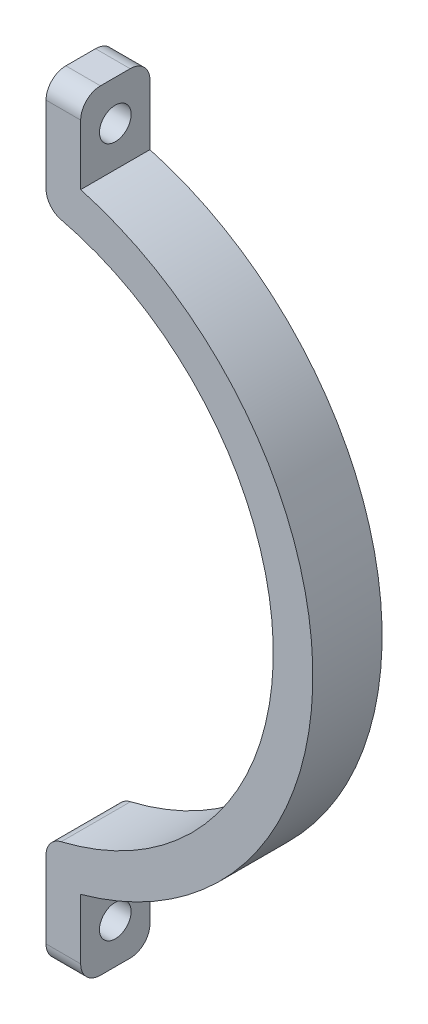
ISO-10303-21;
HEADER;
FILE_DESCRIPTION(('STEP AP214'),'2;1');
FILE_NAME('part.step','',(''),(''),'','','');
FILE_SCHEMA(('AUTOMOTIVE_DESIGN { 1 0 10303 214 1 1 1 1 }'));
ENDSEC;
DATA;
#1=APPLICATION_CONTEXT('core data for automotive mechanical design processes');
#2=APPLICATION_PROTOCOL_DEFINITION('international standard','automotive_design',2000,#1);
#3=PRODUCT_CONTEXT('',#1,'mechanical');
#4=PRODUCT('Part','Part','',(#3));
#5=PRODUCT_RELATED_PRODUCT_CATEGORY('part','',(#4));
#6=PRODUCT_DEFINITION_FORMATION('','',#4);
#7=PRODUCT_DEFINITION_CONTEXT('part definition',#1,'design');
#8=PRODUCT_DEFINITION('design','',#6,#7);
#9=PRODUCT_DEFINITION_SHAPE('','',#8);
#10=(LENGTH_UNIT() NAMED_UNIT(*) SI_UNIT(.MILLI.,.METRE.));
#11=(NAMED_UNIT(*) PLANE_ANGLE_UNIT() SI_UNIT($,.RADIAN.));
#12=(NAMED_UNIT(*) SI_UNIT($,.STERADIAN.) SOLID_ANGLE_UNIT());
#13=UNCERTAINTY_MEASURE_WITH_UNIT(LENGTH_MEASURE(1.E-05),#10,'distance_accuracy_value','');
#14=(GEOMETRIC_REPRESENTATION_CONTEXT(3) GLOBAL_UNCERTAINTY_ASSIGNED_CONTEXT((#13)) GLOBAL_UNIT_ASSIGNED_CONTEXT((#10,
#11,#12)) REPRESENTATION_CONTEXT('',''));
#15=CARTESIAN_POINT('',(0.,0.,0.));
#16=DIRECTION('',(0.,0.,1.));
#17=DIRECTION('',(1.,0.,0.));
#18=AXIS2_PLACEMENT_3D('',#15,#16,#17);
#19=CARTESIAN_POINT('',(103.,-22.5859511028397,-38.));
#20=DIRECTION('',(0.,0.,1.));
#21=DIRECTION('',(1.,0.,0.));
#22=AXIS2_PLACEMENT_3D('',#19,#20,#21);
#23=CYLINDRICAL_SURFACE('',#22,28.);
#24=CARTESIAN_POINT('',(103.,-22.5859511028397,-31.));
#25=DIRECTION('',(0.,0.,-1.));
#26=DIRECTION('',(-1.,0.,0.));
#27=AXIS2_PLACEMENT_3D('',#24,#25,#26);
#28=CIRCLE('',#27,28.);
#29=CARTESIAN_POINT('',(109.564444444444,4.63367544007598,-31.));
#30=VERTEX_POINT('',#29);
#31=CARTESIAN_POINT('',(109.564444444444,-49.8055776457555,-31.));
#32=VERTEX_POINT('',#31);
#33=EDGE_CURVE('E177',#30,#32,#28,.T.);
#34=ORIENTED_EDGE('',*,*,#33,.F.);
#35=DIRECTION('',(0.,0.,1.));
#36=VECTOR('',#35,1.);
#37=CARTESIAN_POINT('',(109.564444444444,4.63367544007599,-38.));
#38=LINE('',#37,#36);
#39=CARTESIAN_POINT('',(109.564444444444,4.63367544007598,-38.));
#40=VERTEX_POINT('',#39);
#41=EDGE_CURVE('E253',#30,#40,#38,.F.);
#42=ORIENTED_EDGE('',*,*,#41,.T.);
#43=CARTESIAN_POINT('',(103.,-22.5859511028397,-38.));
#44=DIRECTION('',(0.,0.,-1.));
#45=DIRECTION('',(-1.,0.,0.));
#46=AXIS2_PLACEMENT_3D('',#43,#44,#45);
#47=CIRCLE('',#46,28.);
#48=CARTESIAN_POINT('',(109.564444444444,-49.8055776457555,-38.));
#49=VERTEX_POINT('',#48);
#50=EDGE_CURVE('E191',#40,#49,#47,.T.);
#51=ORIENTED_EDGE('',*,*,#50,.T.);
#52=DIRECTION('',(0.,0.,1.));
#53=VECTOR('',#52,1.);
#54=CARTESIAN_POINT('',(109.564444444444,-49.8055776457555,-38.));
#55=LINE('',#54,#53);
#56=EDGE_CURVE('E250',#49,#32,#55,.T.);
#57=ORIENTED_EDGE('',*,*,#56,.T.);
#58=EDGE_LOOP('',(#34,#42,#51,#57));
#59=FACE_BOUND('',#58,.T.);
#60=ADVANCED_FACE('F43',(#59),#23,.F.);
#61=CARTESIAN_POINT('',(108.033333333333,1.31702744907367E-13,-38.));
#62=DIRECTION('',(1.,0.,0.));
#63=DIRECTION('',(0.,1.,0.));
#64=AXIS2_PLACEMENT_3D('',#61,#62,#63);
#65=PLANE('',#64);
#66=CARTESIAN_POINT('',(108.033333333333,12.298458831268,-34.5));
#67=DIRECTION('',(1.,0.,0.));
#68=DIRECTION('',(0.,1.,0.));
#69=AXIS2_PLACEMENT_3D('',#66,#67,#68);
#70=CIRCLE('',#69,1.59999999999999);
#71=CARTESIAN_POINT('',(108.033333333333,13.898458831268,-34.5));
#72=VERTEX_POINT('',#71);
#73=EDGE_CURVE('E181',#72,#72,#70,.T.);
#74=ORIENTED_EDGE('',*,*,#73,.T.);
#75=EDGE_LOOP('',(#74));
#76=FACE_BOUND('',#75,.T.);
#77=DIRECTION('',(0.,1.,0.));
#78=VECTOR('',#77,1.);
#79=CARTESIAN_POINT('',(108.033333333333,1.31702744907367E-13,-38.));
#80=LINE('',#79,#78);
#81=CARTESIAN_POINT('',(108.033333333333,6.57793447885567,-38.));
#82=VERTEX_POINT('',#81);
#83=CARTESIAN_POINT('',(108.033333333333,14.341626536467,-38.));
#84=VERTEX_POINT('',#83);
#85=EDGE_CURVE('E154',#82,#84,#80,.T.);
#86=ORIENTED_EDGE('',*,*,#85,.F.);
#87=DIRECTION('',(0.,0.,-1.));
#88=VECTOR('',#87,1.);
#89=CARTESIAN_POINT('',(108.033333333333,6.57793447885567,-31.));
#90=LINE('',#89,#88);
#91=CARTESIAN_POINT('',(108.033333333333,6.57793447885567,-31.));
#92=VERTEX_POINT('',#91);
#93=EDGE_CURVE('E243',#82,#92,#90,.F.);
#94=ORIENTED_EDGE('',*,*,#93,.T.);
#95=DIRECTION('',(0.,1.,0.));
#96=VECTOR('',#95,1.);
#97=CARTESIAN_POINT('',(108.033333333333,1.31702744907367E-13,-31.));
#98=LINE('',#97,#96);
#99=CARTESIAN_POINT('',(108.033333333333,14.341626536467,-31.));
#100=VERTEX_POINT('',#99);
#101=EDGE_CURVE('E180',#92,#100,#98,.T.);
#102=ORIENTED_EDGE('',*,*,#101,.T.);
#103=CARTESIAN_POINT('',(108.033333333333,14.341626536467,-33.));
#104=DIRECTION('',(1.,0.,0.));
#105=DIRECTION('',(0.,1.,0.));
#106=AXIS2_PLACEMENT_3D('',#103,#104,#105);
#107=CIRCLE('',#106,2.);
#108=CARTESIAN_POINT('',(108.033333333333,16.341626536467,-33.));
#109=VERTEX_POINT('',#108);
#110=EDGE_CURVE('E238',#100,#109,#107,.F.);
#111=ORIENTED_EDGE('',*,*,#110,.T.);
#112=DIRECTION('',(0.,0.,1.));
#113=VECTOR('',#112,1.);
#114=CARTESIAN_POINT('',(108.033333333333,16.341626536467,-38.));
#115=LINE('',#114,#113);
#116=CARTESIAN_POINT('',(108.033333333333,16.341626536467,-36.));
#117=VERTEX_POINT('',#116);
#118=EDGE_CURVE('E200',#117,#109,#115,.T.);
#119=ORIENTED_EDGE('',*,*,#118,.F.);
#120=CARTESIAN_POINT('',(108.033333333333,14.341626536467,-36.));
#121=DIRECTION('',(1.,0.,0.));
#122=DIRECTION('',(0.,1.,0.));
#123=AXIS2_PLACEMENT_3D('',#120,#121,#122);
#124=CIRCLE('',#123,2.);
#125=EDGE_CURVE('E240',#117,#84,#124,.F.);
#126=ORIENTED_EDGE('',*,*,#125,.T.);
#127=EDGE_LOOP('',(#86,#94,#102,#111,#119,#126));
#128=FACE_BOUND('',#127,.T.);
#129=ADVANCED_FACE('F261',(#76,#128),#65,.F.);
#130=CARTESIAN_POINT('',(0.,16.341626536467,-38.));
#131=DIRECTION('',(0.,-1.,0.));
#132=DIRECTION('',(0.,0.,-1.));
#133=AXIS2_PLACEMENT_3D('',#130,#131,#132);
#134=PLANE('',#133);
#135=DIRECTION('',(0.,0.,1.));
#136=VECTOR('',#135,1.);
#137=CARTESIAN_POINT('',(111.533333333333,16.341626536467,-38.));
#138=LINE('',#137,#136);
#139=CARTESIAN_POINT('',(111.533333333333,16.341626536467,-36.));
#140=VERTEX_POINT('',#139);
#141=CARTESIAN_POINT('',(111.533333333333,16.341626536467,-33.));
#142=VERTEX_POINT('',#141);
#143=EDGE_CURVE('E163',#140,#142,#138,.T.);
#144=ORIENTED_EDGE('',*,*,#143,.F.);
#145=DIRECTION('',(1.,0.,0.));
#146=VECTOR('',#145,1.);
#147=CARTESIAN_POINT('',(108.033333333333,16.341626536467,-36.));
#148=LINE('',#147,#146);
#149=EDGE_CURVE('E236',#140,#117,#148,.F.);
#150=ORIENTED_EDGE('',*,*,#149,.T.);
#151=ORIENTED_EDGE('',*,*,#118,.T.);
#152=DIRECTION('',(1.,0.,0.));
#153=VECTOR('',#152,1.);
#154=CARTESIAN_POINT('',(0.,16.341626536467,-33.));
#155=LINE('',#154,#153);
#156=EDGE_CURVE('E233',#109,#142,#155,.T.);
#157=ORIENTED_EDGE('',*,*,#156,.T.);
#158=EDGE_LOOP('',(#144,#150,#151,#157));
#159=FACE_BOUND('',#158,.T.);
#160=ADVANCED_FACE('F298',(#159),#134,.F.);
#161=CARTESIAN_POINT('',(111.533333333333,0.,-38.));
#162=DIRECTION('',(-1.,0.,0.));
#163=DIRECTION('',(0.,0.,1.));
#164=AXIS2_PLACEMENT_3D('',#161,#162,#163);
#165=PLANE('',#164);
#166=CARTESIAN_POINT('',(111.533333333333,12.298458831268,-34.5));
#167=DIRECTION('',(1.,0.,0.));
#168=DIRECTION('',(0.,0.,1.));
#169=AXIS2_PLACEMENT_3D('',#166,#167,#168);
#170=CIRCLE('',#169,1.59999999999999);
#171=CARTESIAN_POINT('',(111.533333333333,12.298458831268,-32.9));
#172=VERTEX_POINT('',#171);
#173=EDGE_CURVE('E455',#172,#172,#170,.T.);
#174=ORIENTED_EDGE('',*,*,#173,.F.);
#175=EDGE_LOOP('',(#174));
#176=FACE_BOUND('',#175,.T.);
#177=DIRECTION('',(0.,-1.,0.));
#178=VECTOR('',#177,1.);
#179=CARTESIAN_POINT('',(111.533333333333,0.,-38.));
#180=LINE('',#179,#178);
#181=CARTESIAN_POINT('',(111.533333333333,14.341626536467,-38.));
#182=VERTEX_POINT('',#181);
#183=CARTESIAN_POINT('',(111.533333333333,8.25529112606897,-38.));
#184=VERTEX_POINT('',#183);
#185=EDGE_CURVE('E144',#182,#184,#180,.T.);
#186=ORIENTED_EDGE('',*,*,#185,.F.);
#187=CARTESIAN_POINT('',(111.533333333333,14.341626536467,-36.));
#188=DIRECTION('',(-1.,0.,0.));
#189=DIRECTION('',(0.,0.,1.));
#190=AXIS2_PLACEMENT_3D('',#187,#188,#189);
#191=CIRCLE('',#190,2.);
#192=EDGE_CURVE('E231',#182,#140,#191,.F.);
#193=ORIENTED_EDGE('',*,*,#192,.T.);
#194=ORIENTED_EDGE('',*,*,#143,.T.);
#195=CARTESIAN_POINT('',(111.533333333333,14.341626536467,-33.));
#196=DIRECTION('',(-1.,0.,0.));
#197=DIRECTION('',(0.,0.,1.));
#198=AXIS2_PLACEMENT_3D('',#195,#196,#197);
#199=CIRCLE('',#198,2.);
#200=CARTESIAN_POINT('',(111.533333333333,14.341626536467,-31.));
#201=VERTEX_POINT('',#200);
#202=EDGE_CURVE('E229',#142,#201,#199,.F.);
#203=ORIENTED_EDGE('',*,*,#202,.T.);
#204=DIRECTION('',(0.,-1.,0.));
#205=VECTOR('',#204,1.);
#206=CARTESIAN_POINT('',(111.533333333333,0.,-31.));
#207=LINE('',#206,#205);
#208=CARTESIAN_POINT('',(111.533333333333,8.25529112606897,-31.));
#209=VERTEX_POINT('',#208);
#210=EDGE_CURVE('E160',#201,#209,#207,.T.);
#211=ORIENTED_EDGE('',*,*,#210,.T.);
#212=DIRECTION('',(0.,0.,1.));
#213=VECTOR('',#212,1.);
#214=CARTESIAN_POINT('',(111.533333333333,8.25529112606897,-38.));
#215=LINE('',#214,#213);
#216=EDGE_CURVE('E157',#184,#209,#215,.T.);
#217=ORIENTED_EDGE('',*,*,#216,.F.);
#218=EDGE_LOOP('',(#186,#193,#194,#203,#211,#217));
#219=FACE_BOUND('',#218,.T.);
#220=ADVANCED_FACE('F158',(#176,#219),#165,.F.);
#221=CARTESIAN_POINT('',(103.,-22.5859511028397,-38.));
#222=DIRECTION('',(0.,0.,1.));
#223=DIRECTION('',(1.,0.,0.));
#224=AXIS2_PLACEMENT_3D('',#221,#222,#223);
#225=CYLINDRICAL_SURFACE('',#224,32.);
#226=CARTESIAN_POINT('',(103.,-22.5859511028397,-31.));
#227=DIRECTION('',(0.,0.,-1.));
#228=DIRECTION('',(-1.,0.,0.));
#229=AXIS2_PLACEMENT_3D('',#226,#227,#228);
#230=CIRCLE('',#229,32.);
#231=CARTESIAN_POINT('',(111.533333333333,-53.4271933317485,-31.));
#232=VERTEX_POINT('',#231);
#233=EDGE_CURVE('E184',#209,#232,#230,.T.);
#234=ORIENTED_EDGE('',*,*,#233,.T.);
#235=DIRECTION('',(0.,0.,1.));
#236=VECTOR('',#235,1.);
#237=CARTESIAN_POINT('',(111.533333333333,-53.4271933317485,-38.));
#238=LINE('',#237,#236);
#239=CARTESIAN_POINT('',(111.533333333333,-53.4271933317485,-38.));
#240=VERTEX_POINT('',#239);
#241=EDGE_CURVE('E164',#240,#232,#238,.T.);
#242=ORIENTED_EDGE('',*,*,#241,.F.);
#243=CARTESIAN_POINT('',(103.,-22.5859511028397,-38.));
#244=DIRECTION('',(0.,0.,-1.));
#245=DIRECTION('',(-1.,0.,0.));
#246=AXIS2_PLACEMENT_3D('',#243,#244,#245);
#247=CIRCLE('',#246,32.);
#248=EDGE_CURVE('E149',#184,#240,#247,.T.);
#249=ORIENTED_EDGE('',*,*,#248,.F.);
#250=ORIENTED_EDGE('',*,*,#216,.T.);
#251=EDGE_LOOP('',(#234,#242,#249,#250));
#252=FACE_BOUND('',#251,.T.);
#253=ADVANCED_FACE('F166',(#252),#225,.T.);
#254=CARTESIAN_POINT('',(111.533333333333,0.,-38.));
#255=DIRECTION('',(-1.,0.,0.));
#256=DIRECTION('',(0.,0.,1.));
#257=AXIS2_PLACEMENT_3D('',#254,#255,#256);
#258=PLANE('',#257);
#259=CARTESIAN_POINT('',(111.533333333333,-57.4703610369475,-34.5));
#260=DIRECTION('',(1.,0.,0.));
#261=DIRECTION('',(0.,0.,-1.));
#262=AXIS2_PLACEMENT_3D('',#259,#260,#261);
#263=CIRCLE('',#262,1.6);
#264=CARTESIAN_POINT('',(111.533333333333,-57.4703610369475,-36.1));
#265=VERTEX_POINT('',#264);
#266=EDGE_CURVE('E206',#265,#265,#263,.T.);
#267=ORIENTED_EDGE('',*,*,#266,.F.);
#268=EDGE_LOOP('',(#267));
#269=FACE_BOUND('',#268,.T.);
#270=DIRECTION('',(0.,0.,1.));
#271=VECTOR('',#270,1.);
#272=CARTESIAN_POINT('',(111.533333333333,-61.5135287421465,-38.));
#273=LINE('',#272,#271);
#274=CARTESIAN_POINT('',(111.533333333333,-61.5135287421465,-36.));
#275=VERTEX_POINT('',#274);
#276=CARTESIAN_POINT('',(111.533333333333,-61.5135287421465,-33.));
#277=VERTEX_POINT('',#276);
#278=EDGE_CURVE('E194',#275,#277,#273,.T.);
#279=ORIENTED_EDGE('',*,*,#278,.F.);
#280=CARTESIAN_POINT('',(111.533333333333,-59.5135287421465,-36.));
#281=DIRECTION('',(-1.,0.,0.));
#282=DIRECTION('',(0.,0.,1.));
#283=AXIS2_PLACEMENT_3D('',#280,#281,#282);
#284=CIRCLE('',#283,2.);
#285=CARTESIAN_POINT('',(111.533333333333,-59.5135287421465,-38.));
#286=VERTEX_POINT('',#285);
#287=EDGE_CURVE('E222',#275,#286,#284,.F.);
#288=ORIENTED_EDGE('',*,*,#287,.T.);
#289=DIRECTION('',(0.,-1.,0.));
#290=VECTOR('',#289,1.);
#291=CARTESIAN_POINT('',(111.533333333333,0.,-38.));
#292=LINE('',#291,#290);
#293=EDGE_CURVE('E169',#240,#286,#292,.T.);
#294=ORIENTED_EDGE('',*,*,#293,.F.);
#295=ORIENTED_EDGE('',*,*,#241,.T.);
#296=DIRECTION('',(0.,-1.,0.));
#297=VECTOR('',#296,1.);
#298=CARTESIAN_POINT('',(111.533333333333,0.,-31.));
#299=LINE('',#298,#297);
#300=CARTESIAN_POINT('',(111.533333333333,-59.5135287421465,-31.));
#301=VERTEX_POINT('',#300);
#302=EDGE_CURVE('E186',#232,#301,#299,.T.);
#303=ORIENTED_EDGE('',*,*,#302,.T.);
#304=CARTESIAN_POINT('',(111.533333333333,-59.5135287421465,-33.));
#305=DIRECTION('',(-1.,0.,0.));
#306=DIRECTION('',(0.,0.,1.));
#307=AXIS2_PLACEMENT_3D('',#304,#305,#306);
#308=CIRCLE('',#307,2.);
#309=EDGE_CURVE('E220',#301,#277,#308,.F.);
#310=ORIENTED_EDGE('',*,*,#309,.T.);
#311=EDGE_LOOP('',(#279,#288,#294,#295,#303,#310));
#312=FACE_BOUND('',#311,.T.);
#313=ADVANCED_FACE('F286',(#269,#312),#258,.F.);
#314=CARTESIAN_POINT('',(0.,-61.5135287421465,-38.));
#315=DIRECTION('',(0.,1.,0.));
#316=DIRECTION('',(0.,0.,1.));
#317=AXIS2_PLACEMENT_3D('',#314,#315,#316);
#318=PLANE('',#317);
#319=DIRECTION('',(0.,0.,1.));
#320=VECTOR('',#319,1.);
#321=CARTESIAN_POINT('',(108.033333333333,-61.5135287421465,-38.));
#322=LINE('',#321,#320);
#323=CARTESIAN_POINT('',(108.033333333333,-61.5135287421465,-36.));
#324=VERTEX_POINT('',#323);
#325=CARTESIAN_POINT('',(108.033333333333,-61.5135287421465,-33.));
#326=VERTEX_POINT('',#325);
#327=EDGE_CURVE('E176',#324,#326,#322,.T.);
#328=ORIENTED_EDGE('',*,*,#327,.F.);
#329=DIRECTION('',(-1.,0.,0.));
#330=VECTOR('',#329,1.);
#331=CARTESIAN_POINT('',(111.533333333333,-61.5135287421465,-36.));
#332=LINE('',#331,#330);
#333=EDGE_CURVE('E218',#324,#275,#332,.F.);
#334=ORIENTED_EDGE('',*,*,#333,.T.);
#335=ORIENTED_EDGE('',*,*,#278,.T.);
#336=DIRECTION('',(-1.,0.,0.));
#337=VECTOR('',#336,1.);
#338=CARTESIAN_POINT('',(0.,-61.5135287421465,-33.));
#339=LINE('',#338,#337);
#340=EDGE_CURVE('E215',#277,#326,#339,.T.);
#341=ORIENTED_EDGE('',*,*,#340,.T.);
#342=EDGE_LOOP('',(#328,#334,#335,#341));
#343=FACE_BOUND('',#342,.T.);
#344=ADVANCED_FACE('F281',(#343),#318,.F.);
#345=CARTESIAN_POINT('',(108.033333333334,-2.63405489814734E-13,-38.));
#346=DIRECTION('',(1.,0.,0.));
#347=DIRECTION('',(0.,1.,0.));
#348=AXIS2_PLACEMENT_3D('',#345,#346,#347);
#349=PLANE('',#348);
#350=CARTESIAN_POINT('',(108.033333333333,-57.4703610369475,-34.5));
#351=DIRECTION('',(1.,0.,0.));
#352=DIRECTION('',(0.,1.,0.));
#353=AXIS2_PLACEMENT_3D('',#350,#351,#352);
#354=CIRCLE('',#353,1.6);
#355=CARTESIAN_POINT('',(108.033333333333,-55.8703610369475,-34.5));
#356=VERTEX_POINT('',#355);
#357=EDGE_CURVE('E203',#356,#356,#354,.T.);
#358=ORIENTED_EDGE('',*,*,#357,.T.);
#359=EDGE_LOOP('',(#358));
#360=FACE_BOUND('',#359,.T.);
#361=DIRECTION('',(0.,1.,0.));
#362=VECTOR('',#361,1.);
#363=CARTESIAN_POINT('',(108.033333333334,-2.63405489814734E-13,-31.));
#364=LINE('',#363,#362);
#365=CARTESIAN_POINT('',(108.033333333333,-59.5135287421465,-31.));
#366=VERTEX_POINT('',#365);
#367=CARTESIAN_POINT('',(108.033333333333,-51.7498366845352,-31.));
#368=VERTEX_POINT('',#367);
#369=EDGE_CURVE('E189',#366,#368,#364,.T.);
#370=ORIENTED_EDGE('',*,*,#369,.T.);
#371=DIRECTION('',(0.,0.,-1.));
#372=VECTOR('',#371,1.);
#373=CARTESIAN_POINT('',(108.033333333333,-51.7498366845352,-38.));
#374=LINE('',#373,#372);
#375=CARTESIAN_POINT('',(108.033333333333,-51.7498366845352,-38.));
#376=VERTEX_POINT('',#375);
#377=EDGE_CURVE('E12',#368,#376,#374,.T.);
#378=ORIENTED_EDGE('',*,*,#377,.T.);
#379=DIRECTION('',(0.,1.,0.));
#380=VECTOR('',#379,1.);
#381=CARTESIAN_POINT('',(108.033333333334,-2.63405489814734E-13,-38.));
#382=LINE('',#381,#380);
#383=CARTESIAN_POINT('',(108.033333333333,-59.5135287421465,-38.));
#384=VERTEX_POINT('',#383);
#385=EDGE_CURVE('E171',#384,#376,#382,.T.);
#386=ORIENTED_EDGE('',*,*,#385,.F.);
#387=CARTESIAN_POINT('',(108.033333333333,-59.5135287421465,-36.));
#388=DIRECTION('',(1.,0.,0.));
#389=DIRECTION('',(0.,1.,0.));
#390=AXIS2_PLACEMENT_3D('',#387,#388,#389);
#391=CIRCLE('',#390,2.);
#392=EDGE_CURVE('E213',#384,#324,#391,.F.);
#393=ORIENTED_EDGE('',*,*,#392,.T.);
#394=ORIENTED_EDGE('',*,*,#327,.T.);
#395=CARTESIAN_POINT('',(108.033333333333,-59.5135287421465,-33.));
#396=DIRECTION('',(1.,0.,0.));
#397=DIRECTION('',(0.,1.,0.));
#398=AXIS2_PLACEMENT_3D('',#395,#396,#397);
#399=CIRCLE('',#398,2.);
#400=EDGE_CURVE('E211',#326,#366,#399,.F.);
#401=ORIENTED_EDGE('',*,*,#400,.T.);
#402=EDGE_LOOP('',(#370,#378,#386,#393,#394,#401));
#403=FACE_BOUND('',#402,.T.);
#404=ADVANCED_FACE('F274',(#360,#403),#349,.F.);
#405=CARTESIAN_POINT('',(0.,0.,-38.));
#406=DIRECTION('',(0.,0.,-1.));
#407=DIRECTION('',(-1.,0.,0.));
#408=AXIS2_PLACEMENT_3D('',#405,#406,#407);
#409=PLANE('',#408);
#410=ORIENTED_EDGE('',*,*,#50,.F.);
#411=CARTESIAN_POINT('',(110.033333333333,6.57793447885567,-38.));
#412=DIRECTION('',(0.,0.,-1.));
#413=DIRECTION('',(-1.,0.,0.));
#414=AXIS2_PLACEMENT_3D('',#411,#412,#413);
#415=CIRCLE('',#414,2.);
#416=EDGE_CURVE('E51',#40,#82,#415,.T.);
#417=ORIENTED_EDGE('',*,*,#416,.T.);
#418=ORIENTED_EDGE('',*,*,#85,.T.);
#419=DIRECTION('',(1.,0.,0.));
#420=VECTOR('',#419,1.);
#421=CARTESIAN_POINT('',(111.533333333333,14.341626536467,-38.));
#422=LINE('',#421,#420);
#423=EDGE_CURVE('E152',#84,#182,#422,.T.);
#424=ORIENTED_EDGE('',*,*,#423,.T.);
#425=ORIENTED_EDGE('',*,*,#185,.T.);
#426=ORIENTED_EDGE('',*,*,#248,.T.);
#427=ORIENTED_EDGE('',*,*,#293,.T.);
#428=DIRECTION('',(-1.,0.,0.));
#429=VECTOR('',#428,1.);
#430=CARTESIAN_POINT('',(108.033333333333,-59.5135287421465,-38.));
#431=LINE('',#430,#429);
#432=EDGE_CURVE('E208',#286,#384,#431,.T.);
#433=ORIENTED_EDGE('',*,*,#432,.T.);
#434=ORIENTED_EDGE('',*,*,#385,.T.);
#435=CARTESIAN_POINT('',(110.033333333333,-51.7498366845352,-38.));
#436=DIRECTION('',(0.,0.,-1.));
#437=DIRECTION('',(-1.,0.,0.));
#438=AXIS2_PLACEMENT_3D('',#435,#436,#437);
#439=CIRCLE('',#438,2.);
#440=EDGE_CURVE('E63',#376,#49,#439,.T.);
#441=ORIENTED_EDGE('',*,*,#440,.T.);
#442=EDGE_LOOP('',(#410,#417,#418,#424,#425,#426,#427,#433,#434,#441));
#443=FACE_BOUND('',#442,.T.);
#444=ADVANCED_FACE('F146',(#443),#409,.T.);
#445=CARTESIAN_POINT('',(0.,0.,-31.));
#446=DIRECTION('',(0.,0.,-1.));
#447=DIRECTION('',(-1.,0.,0.));
#448=AXIS2_PLACEMENT_3D('',#445,#446,#447);
#449=PLANE('',#448);
#450=ORIENTED_EDGE('',*,*,#101,.F.);
#451=CARTESIAN_POINT('',(110.033333333333,6.57793447885567,-31.));
#452=DIRECTION('',(0.,0.,-1.));
#453=DIRECTION('',(-1.,0.,0.));
#454=AXIS2_PLACEMENT_3D('',#451,#452,#453);
#455=CIRCLE('',#454,2.);
#456=EDGE_CURVE('E248',#92,#30,#455,.F.);
#457=ORIENTED_EDGE('',*,*,#456,.T.);
#458=ORIENTED_EDGE('',*,*,#33,.T.);
#459=CARTESIAN_POINT('',(110.033333333333,-51.7498366845352,-31.));
#460=DIRECTION('',(0.,0.,-1.));
#461=DIRECTION('',(-1.,0.,0.));
#462=AXIS2_PLACEMENT_3D('',#459,#460,#461);
#463=CIRCLE('',#462,2.);
#464=EDGE_CURVE('E246',#32,#368,#463,.F.);
#465=ORIENTED_EDGE('',*,*,#464,.T.);
#466=ORIENTED_EDGE('',*,*,#369,.F.);
#467=DIRECTION('',(-1.,0.,0.));
#468=VECTOR('',#467,1.);
#469=CARTESIAN_POINT('',(0.,-59.5135287421465,-31.));
#470=LINE('',#469,#468);
#471=EDGE_CURVE('E227',#366,#301,#470,.F.);
#472=ORIENTED_EDGE('',*,*,#471,.T.);
#473=ORIENTED_EDGE('',*,*,#302,.F.);
#474=ORIENTED_EDGE('',*,*,#233,.F.);
#475=ORIENTED_EDGE('',*,*,#210,.F.);
#476=DIRECTION('',(1.,0.,0.));
#477=VECTOR('',#476,1.);
#478=CARTESIAN_POINT('',(0.,14.341626536467,-31.));
#479=LINE('',#478,#477);
#480=EDGE_CURVE('E224',#201,#100,#479,.F.);
#481=ORIENTED_EDGE('',*,*,#480,.T.);
#482=EDGE_LOOP('',(#450,#457,#458,#465,#466,#472,#473,#474,#475,#481));
#483=FACE_BOUND('',#482,.T.);
#484=ADVANCED_FACE('F268',(#483),#449,.F.);
#485=CARTESIAN_POINT('',(84.5333333333333,-57.4703610369475,-34.5));
#486=DIRECTION('',(1.,0.,0.));
#487=DIRECTION('',(0.,0.,-1.));
#488=AXIS2_PLACEMENT_3D('',#485,#486,#487);
#489=CYLINDRICAL_SURFACE('',#488,1.6);
#490=ORIENTED_EDGE('',*,*,#266,.T.);
#491=EDGE_LOOP('',(#490));
#492=FACE_BOUND('',#491,.T.);
#493=ORIENTED_EDGE('',*,*,#357,.F.);
#494=EDGE_LOOP('',(#493));
#495=FACE_BOUND('',#494,.T.);
#496=ADVANCED_FACE('F324',(#492,#495),#489,.F.);
#497=CARTESIAN_POINT('',(84.5333333333333,12.298458831268,-34.5));
#498=DIRECTION('',(1.,0.,0.));
#499=DIRECTION('',(0.,0.,-1.));
#500=AXIS2_PLACEMENT_3D('',#497,#498,#499);
#501=CYLINDRICAL_SURFACE('',#500,1.59999999999999);
#502=ORIENTED_EDGE('',*,*,#173,.T.);
#503=EDGE_LOOP('',(#502));
#504=FACE_BOUND('',#503,.T.);
#505=ORIENTED_EDGE('',*,*,#73,.F.);
#506=EDGE_LOOP('',(#505));
#507=FACE_BOUND('',#506,.T.);
#508=ADVANCED_FACE('F320',(#504,#507),#501,.F.);
#509=CARTESIAN_POINT('',(0.,-59.5135287421465,-36.));
#510=DIRECTION('',(1.,0.,0.));
#511=DIRECTION('',(0.,0.,-1.));
#512=AXIS2_PLACEMENT_3D('',#509,#510,#511);
#513=CYLINDRICAL_SURFACE('',#512,2.);
#514=ORIENTED_EDGE('',*,*,#287,.F.);
#515=ORIENTED_EDGE('',*,*,#333,.F.);
#516=ORIENTED_EDGE('',*,*,#392,.F.);
#517=ORIENTED_EDGE('',*,*,#432,.F.);
#518=EDGE_LOOP('',(#514,#515,#516,#517));
#519=FACE_BOUND('',#518,.T.);
#520=ADVANCED_FACE('F289',(#519),#513,.T.);
#521=CARTESIAN_POINT('',(0.,-59.5135287421465,-33.));
#522=DIRECTION('',(-1.,0.,0.));
#523=DIRECTION('',(0.,0.,1.));
#524=AXIS2_PLACEMENT_3D('',#521,#522,#523);
#525=CYLINDRICAL_SURFACE('',#524,2.);
#526=ORIENTED_EDGE('',*,*,#309,.F.);
#527=ORIENTED_EDGE('',*,*,#471,.F.);
#528=ORIENTED_EDGE('',*,*,#400,.F.);
#529=ORIENTED_EDGE('',*,*,#340,.F.);
#530=EDGE_LOOP('',(#526,#527,#528,#529));
#531=FACE_BOUND('',#530,.T.);
#532=ADVANCED_FACE('F279',(#531),#525,.T.);
#533=CARTESIAN_POINT('',(0.,14.341626536467,-36.));
#534=DIRECTION('',(-1.,0.,0.));
#535=DIRECTION('',(0.,0.,1.));
#536=AXIS2_PLACEMENT_3D('',#533,#534,#535);
#537=CYLINDRICAL_SURFACE('',#536,2.);
#538=ORIENTED_EDGE('',*,*,#125,.F.);
#539=ORIENTED_EDGE('',*,*,#149,.F.);
#540=ORIENTED_EDGE('',*,*,#192,.F.);
#541=ORIENTED_EDGE('',*,*,#423,.F.);
#542=EDGE_LOOP('',(#538,#539,#540,#541));
#543=FACE_BOUND('',#542,.T.);
#544=ADVANCED_FACE('F301',(#543),#537,.T.);
#545=CARTESIAN_POINT('',(0.,14.341626536467,-33.));
#546=DIRECTION('',(1.,0.,0.));
#547=DIRECTION('',(0.,0.,-1.));
#548=AXIS2_PLACEMENT_3D('',#545,#546,#547);
#549=CYLINDRICAL_SURFACE('',#548,2.);
#550=ORIENTED_EDGE('',*,*,#110,.F.);
#551=ORIENTED_EDGE('',*,*,#480,.F.);
#552=ORIENTED_EDGE('',*,*,#202,.F.);
#553=ORIENTED_EDGE('',*,*,#156,.F.);
#554=EDGE_LOOP('',(#550,#551,#552,#553));
#555=FACE_BOUND('',#554,.T.);
#556=ADVANCED_FACE('F294',(#555),#549,.T.);
#557=CARTESIAN_POINT('',(110.033333333333,6.57793447885567,-38.));
#558=DIRECTION('',(0.,0.,1.));
#559=DIRECTION('',(1.,0.,0.));
#560=AXIS2_PLACEMENT_3D('',#557,#558,#559);
#561=CYLINDRICAL_SURFACE('',#560,2.);
#562=ORIENTED_EDGE('',*,*,#416,.F.);
#563=ORIENTED_EDGE('',*,*,#41,.F.);
#564=ORIENTED_EDGE('',*,*,#456,.F.);
#565=ORIENTED_EDGE('',*,*,#93,.F.);
#566=EDGE_LOOP('',(#562,#563,#564,#565));
#567=FACE_BOUND('',#566,.T.);
#568=ADVANCED_FACE('F265',(#567),#561,.T.);
#569=CARTESIAN_POINT('',(110.033333333333,-51.7498366845352,-38.));
#570=DIRECTION('',(0.,0.,1.));
#571=DIRECTION('',(1.,0.,0.));
#572=AXIS2_PLACEMENT_3D('',#569,#570,#571);
#573=CYLINDRICAL_SURFACE('',#572,2.);
#574=ORIENTED_EDGE('',*,*,#440,.F.);
#575=ORIENTED_EDGE('',*,*,#377,.F.);
#576=ORIENTED_EDGE('',*,*,#464,.F.);
#577=ORIENTED_EDGE('',*,*,#56,.F.);
#578=EDGE_LOOP('',(#574,#575,#576,#577));
#579=FACE_BOUND('',#578,.T.);
#580=ADVANCED_FACE('F45',(#579),#573,.T.);
#581=CLOSED_SHELL('',(#60,#129,#160,#220,#253,#313,#344,#404,#444,#484,#496,#508,#520,#532,#544,
#556,#568,#580));
#582=MANIFOLD_SOLID_BREP('B2',#581);
#583=ADVANCED_BREP_SHAPE_REPRESENTATION('',(#18,#582),#14);
#584=SHAPE_DEFINITION_REPRESENTATION(#9,#583);
ENDSEC;
END-ISO-10303-21;
